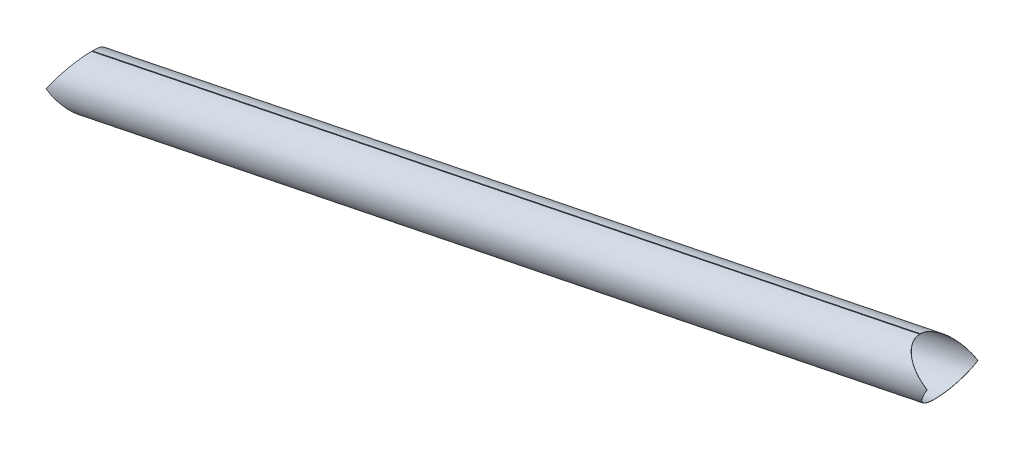
ISO-10303-21;
HEADER;
FILE_DESCRIPTION(('STEP AP214'),'2;1');
FILE_NAME('part.step','',(''),(''),'','','');
FILE_SCHEMA(('AUTOMOTIVE_DESIGN { 1 0 10303 214 1 1 1 1 }'));
ENDSEC;
DATA;
#1=APPLICATION_CONTEXT('core data for automotive mechanical design processes');
#2=APPLICATION_PROTOCOL_DEFINITION('international standard','automotive_design',2000,#1);
#3=PRODUCT_CONTEXT('',#1,'mechanical');
#4=PRODUCT('Part','Part','',(#3));
#5=PRODUCT_RELATED_PRODUCT_CATEGORY('part','',(#4));
#6=PRODUCT_DEFINITION_FORMATION('','',#4);
#7=PRODUCT_DEFINITION_CONTEXT('part definition',#1,'design');
#8=PRODUCT_DEFINITION('design','',#6,#7);
#9=PRODUCT_DEFINITION_SHAPE('','',#8);
#10=(LENGTH_UNIT() NAMED_UNIT(*) SI_UNIT(.MILLI.,.METRE.));
#11=(NAMED_UNIT(*) PLANE_ANGLE_UNIT() SI_UNIT($,.RADIAN.));
#12=(NAMED_UNIT(*) SI_UNIT($,.STERADIAN.) SOLID_ANGLE_UNIT());
#13=UNCERTAINTY_MEASURE_WITH_UNIT(LENGTH_MEASURE(1.E-05),#10,'distance_accuracy_value','');
#14=(GEOMETRIC_REPRESENTATION_CONTEXT(3) GLOBAL_UNCERTAINTY_ASSIGNED_CONTEXT((#13)) GLOBAL_UNIT_ASSIGNED_CONTEXT((#10,
#11,#12)) REPRESENTATION_CONTEXT('',''));
#15=CARTESIAN_POINT('',(0.,0.,0.));
#16=DIRECTION('',(0.,0.,1.));
#17=DIRECTION('',(1.,0.,0.));
#18=AXIS2_PLACEMENT_3D('',#15,#16,#17);
#19=CARTESIAN_POINT('',(495.062825272068,513.488846266379,-1.12852863294449E-10));
#20=CARTESIAN_POINT('',(495.069492097507,513.456186435551,-1.1284501447802E-10));
#21=CARTESIAN_POINT('',(495.076158922945,513.423526604724,-1.12837165661591E-10));
#22=CARTESIAN_POINT('',(495.082825748384,513.390866773896,-1.12829316845163E-10));
#23=CARTESIAN_POINT('',(495.062825272068,513.488846266371,-31.5000000001128));
#24=CARTESIAN_POINT('',(495.069492097507,513.456186435544,-31.5666666667795));
#25=CARTESIAN_POINT('',(495.076158922946,513.423526604716,-31.6333333334462));
#26=CARTESIAN_POINT('',(495.082825748384,513.390866773889,-31.7000000001128));
#27=CARTESIAN_POINT('',(454.591151385622,537.376980259267,-31.5000000001187));
#28=CARTESIAN_POINT('',(454.584484560184,537.409640090095,-31.5666666667854));
#29=CARTESIAN_POINT('',(454.577817734745,537.442299920922,-31.6333333334521));
#30=CARTESIAN_POINT('',(454.571150909306,537.474959751749,-31.7000000001188));
#31=CARTESIAN_POINT('',(454.591151385622,537.376980259274,-1.18753017777534E-10));
#32=CARTESIAN_POINT('',(454.584484560183,537.409640090102,-1.18760870676119E-10));
#33=CARTESIAN_POINT('',(454.577817734745,537.442299920929,-1.18768723574703E-10));
#34=CARTESIAN_POINT('',(454.571150909306,537.474959751757,-1.18776576473288E-10));
#35=CARTESIAN_POINT('',(454.591151385622,537.376980259282,31.4999999998812));
#36=CARTESIAN_POINT('',(454.584484560183,537.40964009011,31.5666666665479));
#37=CARTESIAN_POINT('',(454.577817734745,537.442299920937,31.6333333332145));
#38=CARTESIAN_POINT('',(454.571150909306,537.474959751764,31.6999999998812));
#39=CARTESIAN_POINT('',(495.062825272068,513.488846266386,31.4999999998871));
#40=CARTESIAN_POINT('',(495.069492097507,513.456186435559,31.5666666665538));
#41=CARTESIAN_POINT('',(495.076158922945,513.423526604731,31.6333333332205));
#42=CARTESIAN_POINT('',(495.082825748384,513.390866773904,31.6999999998871));
#43=CARTESIAN_POINT('',(495.062825272068,513.488846266379,-1.12852863294449E-10));
#44=CARTESIAN_POINT('',(495.069492097507,513.456186435551,-1.1284501447802E-10));
#45=CARTESIAN_POINT('',(495.076158922945,513.423526604724,-1.12837165661591E-10));
#46=CARTESIAN_POINT('',(495.082825748384,513.390866773896,-1.12829316845163E-10));
#47=(BOUNDED_SURFACE() B_SPLINE_SURFACE(3,3,((#19,#20,#21,#22),(#23,#24,#25,#26),(#27,#28,#29,
#30),(#31,#32,#33,#34),(#35,#36,#37,#38),(#39,#40,#41,#42),(#43,#44,#45,#46)),.UNSPECIFIED.,.T.,
.F.,.F.) B_SPLINE_SURFACE_WITH_KNOTS((4,3,4),(4,4),(0.,0.5,1.),(0.,1.),
.UNSPECIFIED.) GEOMETRIC_REPRESENTATION_ITEM() RATIONAL_B_SPLINE_SURFACE(((1.,1.,1.,1.),
(0.333333333333333,0.333333333333333,0.333333333333333,0.333333333333333),(0.333333333333333,
0.333333333333333,0.333333333333333,0.333333333333333),(1.,1.,1.,1.),(0.333333333333333,
0.333333333333333,0.333333333333333,0.333333333333333),(0.333333333333333,0.333333333333333,
0.333333333333333,0.333333333333333),(1.,1.,1.,1.))) REPRESENTATION_ITEM('') SURFACE());
#48=DIRECTION('',(0.,2.38155096765019E-13,1.));
#49=VECTOR('',#48,1.);
#50=CARTESIAN_POINT('',(474.826988328845,525.43291326283,15.8499999998842));
#51=LINE('',#50,#49);
#52=CARTESIAN_POINT('',(474.826988328845,525.43291326283,15.7499999998842));
#53=VERTEX_POINT('',#52);
#54=CARTESIAN_POINT('',(474.826988328845,525.43291326283,15.8499999998842));
#55=VERTEX_POINT('',#54);
#56=EDGE_CURVE('E11',#53,#55,#51,.T.);
#57=CARTESIAN_POINT('',(474.826988328845,525.432913262827,-1.15801976126637E-10));
#58=DIRECTION('',(0.508304270122154,0.861177547881727,-2.03932847172194E-13));
#59=DIRECTION('',(0.861177547881727,-0.508304270122154,1.25505545650333E-13));
#60=AXIS2_PLACEMENT_3D('',#57,#58,#59);
#61=ELLIPSE('',#60,23.4978686950189,15.75);
#62=CARTESIAN_POINT('',(454.59403916192,537.375275768688,0.266073271324946));
#63=VERTEX_POINT('',#62);
#64=EDGE_CURVE('E128',#63,#53,#61,.T.);
#65=DIRECTION('',(-0.199976221267158,0.979655102165405,0.016893541043806));
#66=VECTOR('',#65,1.);
#67=CARTESIAN_POINT('',(454.574041539793,537.473241278905,0.267762625429327));
#68=LINE('',#67,#66);
#69=CARTESIAN_POINT('',(454.574041539793,537.473241278905,0.267762625429327));
#70=VERTEX_POINT('',#69);
#71=EDGE_CURVE('E60',#63,#70,#68,.T.);
#72=CARTESIAN_POINT('',(474.826988328845,525.432913262827,-1.15801976126637E-10));
#73=DIRECTION('',(0.511013787156626,0.859572515460937,-2.0353659132569E-13));
#74=DIRECTION('',(0.859572515460937,-0.511013787156626,1.26147152707719E-13));
#75=AXIS2_PLACEMENT_3D('',#72,#73,#74);
#76=ELLIPSE('',#75,23.5650129049052,15.85);
#77=EDGE_CURVE('E197',#70,#55,#76,.T.);
#78=ORIENTED_EDGE('',*,*,#56,.F.);
#79=ORIENTED_EDGE('',*,*,#64,.F.);
#80=ORIENTED_EDGE('',*,*,#71,.T.);
#81=ORIENTED_EDGE('',*,*,#77,.T.);
#82=EDGE_LOOP('',(#78,#79,#80,#81));
#83=FACE_BOUND('',#82,.T.);
#84=ADVANCED_FACE('F47',(#83),#47,.F.);
#85=CARTESIAN_POINT('',(197.211004514227,484.937928060556,0.267762625440766));
#86=DIRECTION('',(0.00337878867538019,-0.0165522057770522,0.999857293952993));
#87=DIRECTION('',(0.979794924826004,0.200004763156293,0.));
#88=AXIS2_PLACEMENT_3D('',#85,#86,#87);
#89=PLANE('',#88);
#90=ORIENTED_EDGE('',*,*,#71,.F.);
#91=DIRECTION('',(0.979794924826004,0.200004763156293,0.));
#92=VECTOR('',#91,1.);
#93=CARTESIAN_POINT('',(-76.0818601050684,429.048824124233,0.266073271348534));
#94=LINE('',#93,#92);
#95=CARTESIAN_POINT('',(-60.1320348892134,432.30464933199,0.266073271347825));
#96=VERTEX_POINT('',#95);
#97=EDGE_CURVE('E164',#96,#63,#94,.T.);
#98=ORIENTED_EDGE('',*,*,#97,.F.);
#99=DIRECTION('',(-0.19997622126716,0.979655102165405,0.016893541043806));
#100=VECTOR('',#99,1.);
#101=CARTESIAN_POINT('',(-60.1520325113401,432.402614842207,0.267762625452205));
#102=LINE('',#101,#100);
#103=CARTESIAN_POINT('',(-60.1520325113401,432.402614842207,0.267762625452205));
#104=VERTEX_POINT('',#103);
#105=EDGE_CURVE('E188',#96,#104,#102,.T.);
#106=ORIENTED_EDGE('',*,*,#105,.T.);
#107=DIRECTION('',(0.979794924826004,0.200004763156293,0.));
#108=VECTOR('',#107,1.);
#109=CARTESIAN_POINT('',(-76.1018577271951,429.146789634449,0.267762625452914));
#110=LINE('',#109,#108);
#111=EDGE_CURVE('E207',#104,#70,#110,.T.);
#112=ORIENTED_EDGE('',*,*,#111,.T.);
#113=EDGE_LOOP('',(#90,#98,#106,#112));
#114=FACE_BOUND('',#113,.T.);
#115=ADVANCED_FACE('F212',(#114),#89,.F.);
#116=CARTESIAN_POINT('',(-60.150208438911,432.405295723637,-9.55668955902229E-11));
#117=CARTESIAN_POINT('',(-60.1435416134725,432.37263589281,-9.55596749175297E-11));
#118=CARTESIAN_POINT('',(-60.1368747880339,432.339976061982,-9.55524542448365E-11));
#119=CARTESIAN_POINT('',(-60.1302079625954,432.307316231154,-9.55452335721434E-11));
#120=CARTESIAN_POINT('',(-60.150208438911,432.40529572363,-31.7000000000956));
#121=CARTESIAN_POINT('',(-60.1435416134725,432.372635892803,-31.6333333334289));
#122=CARTESIAN_POINT('',(-60.136874788034,432.339976061975,-31.5666666667622));
#123=CARTESIAN_POINT('',(-60.1302079625954,432.307316231147,-31.5000000000956));
#124=CARTESIAN_POINT('',(-85.7142608013111,394.833216806611,-31.7000000000873));
#125=CARTESIAN_POINT('',(-85.7209276267496,394.865876637439,-31.6333333334206));
#126=CARTESIAN_POINT('',(-85.7275944521882,394.898536468267,-31.566666666754));
#127=CARTESIAN_POINT('',(-85.7342612776267,394.931196299094,-31.5000000000873));
#128=CARTESIAN_POINT('',(-85.7142608013111,394.833216806618,-8.72799701098123E-11));
#129=CARTESIAN_POINT('',(-85.7209276267496,394.865876637446,-8.72871948646615E-11));
#130=CARTESIAN_POINT('',(-85.7275944521882,394.898536468274,-8.72944196195107E-11));
#131=CARTESIAN_POINT('',(-85.7342612776267,394.931196299101,-8.73016443743598E-11));
#132=CARTESIAN_POINT('',(-85.7142608013111,394.833216806626,31.6999999999127));
#133=CARTESIAN_POINT('',(-85.7209276267497,394.865876637453,31.6333333332461));
#134=CARTESIAN_POINT('',(-85.7275944521882,394.898536468281,31.5666666665794));
#135=CARTESIAN_POINT('',(-85.7342612776267,394.931196299108,31.4999999999127));
#136=CARTESIAN_POINT('',(-60.1502084389111,432.405295723644,31.6999999999044));
#137=CARTESIAN_POINT('',(-60.1435416134725,432.372635892817,31.6333333332378));
#138=CARTESIAN_POINT('',(-60.136874788034,432.339976061989,31.5666666665711));
#139=CARTESIAN_POINT('',(-60.1302079625954,432.307316231161,31.4999999999045));
#140=CARTESIAN_POINT('',(-60.150208438911,432.405295723637,-9.55668955902229E-11));
#141=CARTESIAN_POINT('',(-60.1435416134725,432.37263589281,-9.55596749175297E-11));
#142=CARTESIAN_POINT('',(-60.1368747880339,432.339976061982,-9.55524542448365E-11));
#143=CARTESIAN_POINT('',(-60.1302079625954,432.307316231154,-9.55452335721434E-11));
#144=(BOUNDED_SURFACE() B_SPLINE_SURFACE(3,3,((#116,#117,#118,#119),(#120,#121,#122,#123),(#124,
#125,#126,#127),(#128,#129,#130,#131),(#132,#133,#134,#135),(#136,#137,#138,#139),(#140,#141,
#142,#143)),.UNSPECIFIED.,.T.,.F.,.F.) B_SPLINE_SURFACE_WITH_KNOTS((4,3,4),(4,4),(0.,0.5,1.),
(0.,1.),.UNSPECIFIED.) GEOMETRIC_REPRESENTATION_ITEM() RATIONAL_B_SPLINE_SURFACE(((1.,1.,1.,1.),
(0.333333333333333,0.333333333333333,0.333333333333333,0.333333333333333),(0.333333333333333,
0.333333333333333,0.333333333333333,0.333333333333333),(1.,1.,1.,1.),(0.333333333333333,
0.333333333333333,0.333333333333333,0.333333333333333),(0.333333333333333,0.333333333333333,
0.333333333333333,0.333333333333333),(1.,1.,1.,1.))) REPRESENTATION_ITEM('') SURFACE());
#145=CARTESIAN_POINT('',(-72.9322346201111,413.619256265128,-9.14244033826059E-11));
#146=DIRECTION('',(0.824989080461625,-0.565148668156515,1.25411033938024E-13));
#147=DIRECTION('',(0.565148668156515,0.824989080461625,-1.81915079199514E-13));
#148=AXIS2_PLACEMENT_3D('',#145,#146,#147);
#149=ELLIPSE('',#148,22.6524937221832,15.75);
#150=CARTESIAN_POINT('',(-72.9322346201111,413.619256265131,15.7499999999086));
#151=VERTEX_POINT('',#150);
#152=EDGE_CURVE('E160',#151,#96,#149,.F.);
#153=DIRECTION('',(0.,2.19465775470557E-13,1.));
#154=VECTOR('',#153,1.);
#155=CARTESIAN_POINT('',(-72.9322346201111,413.619256265131,15.8499999999086));
#156=LINE('',#155,#154);
#157=CARTESIAN_POINT('',(-72.9322346201111,413.619256265131,15.8499999999086));
#158=VERTEX_POINT('',#157);
#159=EDGE_CURVE('E185',#151,#158,#156,.T.);
#160=CARTESIAN_POINT('',(-72.9322346201111,413.619256265128,-9.14244033826059E-11));
#161=DIRECTION('',(0.826772594060492,-0.562536290127565,1.24834984827299E-13));
#162=DIRECTION('',(0.562536290127566,0.826772594060492,-1.82310860994998E-13));
#163=AXIS2_PLACEMENT_3D('',#160,#161,#162);
#164=ELLIPSE('',#163,22.7221361635202,15.85);
#165=EDGE_CURVE('E214',#158,#104,#164,.F.);
#166=ORIENTED_EDGE('',*,*,#105,.F.);
#167=ORIENTED_EDGE('',*,*,#152,.F.);
#168=ORIENTED_EDGE('',*,*,#159,.T.);
#169=ORIENTED_EDGE('',*,*,#165,.T.);
#170=EDGE_LOOP('',(#166,#167,#168,#169));
#171=FACE_BOUND('',#170,.T.);
#172=ADVANCED_FACE('F281',(#171),#144,.T.);
#173=CARTESIAN_POINT('',(-54.6435793764522,401.175650434336,-8.86629862574432E-11));
#174=CARTESIAN_POINT('',(-54.6502462018908,401.208310265164,-8.86702069301363E-11));
#175=CARTESIAN_POINT('',(-54.6569130273293,401.240970095991,-8.86774276028295E-11));
#176=CARTESIAN_POINT('',(-54.6635798527679,401.273629926819,-8.86846482755227E-11));
#177=CARTESIAN_POINT('',(-54.6435793764523,401.175650434343,31.6999999999113));
#178=CARTESIAN_POINT('',(-54.6502462018908,401.208310265171,31.6333333332447));
#179=CARTESIAN_POINT('',(-54.6569130273293,401.240970095998,31.566666666578));
#180=CARTESIAN_POINT('',(-54.6635798527679,401.273629926826,31.4999999999113));
#181=CARTESIAN_POINT('',(-91.2208898637699,426.062862095926,31.6999999999058));
#182=CARTESIAN_POINT('',(-91.2142230383314,426.030202265099,31.6333333332392));
#183=CARTESIAN_POINT('',(-91.2075562128928,425.997542434271,31.5666666665725));
#184=CARTESIAN_POINT('',(-91.2008893874543,425.964882603444,31.4999999999058));
#185=CARTESIAN_POINT('',(-91.2208898637699,426.062862095919,-9.41877615729453E-11));
#186=CARTESIAN_POINT('',(-91.2142230383313,426.030202265092,-9.41805368180961E-11));
#187=CARTESIAN_POINT('',(-91.2075562128928,425.997542434264,-9.4173312063247E-11));
#188=CARTESIAN_POINT('',(-91.2008893874542,425.964882603437,-9.41660873083978E-11));
#189=CARTESIAN_POINT('',(-91.2208898637699,426.062862095912,-31.7000000000942));
#190=CARTESIAN_POINT('',(-91.2142230383313,426.030202265085,-31.6333333334275));
#191=CARTESIAN_POINT('',(-91.2075562128928,425.997542434257,-31.5666666667608));
#192=CARTESIAN_POINT('',(-91.2008893874542,425.96488260343,-31.5000000000942));
#193=CARTESIAN_POINT('',(-54.6435793764522,401.175650434329,-31.7000000000887));
#194=CARTESIAN_POINT('',(-54.6502462018908,401.208310265157,-31.633333333422));
#195=CARTESIAN_POINT('',(-54.6569130273293,401.240970095984,-31.5666666667553));
#196=CARTESIAN_POINT('',(-54.6635798527679,401.273629926812,-31.5000000000887));
#197=CARTESIAN_POINT('',(-54.6435793764522,401.175650434336,-8.86629862574432E-11));
#198=CARTESIAN_POINT('',(-54.6502462018908,401.208310265164,-8.86702069301363E-11));
#199=CARTESIAN_POINT('',(-54.6569130273293,401.240970095991,-8.86774276028295E-11));
#200=CARTESIAN_POINT('',(-54.6635798527679,401.273629926819,-8.86846482755227E-11));
#201=(BOUNDED_SURFACE() B_SPLINE_SURFACE(3,3,((#173,#174,#175,#176),(#177,#178,#179,#180),(#181,
#182,#183,#184),(#185,#186,#187,#188),(#189,#190,#191,#192),(#193,#194,#195,#196),(#197,#198,
#199,#200)),.UNSPECIFIED.,.T.,.F.,.F.) B_SPLINE_SURFACE_WITH_KNOTS((4,3,4),(4,4),(0.,0.5,1.),
(0.,1.),.UNSPECIFIED.) GEOMETRIC_REPRESENTATION_ITEM() RATIONAL_B_SPLINE_SURFACE(((1.,1.,1.,1.),
(0.333333333333333,0.333333333333333,0.333333333333333,0.333333333333333),(0.333333333333333,
0.333333333333333,0.333333333333333,0.333333333333333),(1.,1.,1.,1.),(0.333333333333333,
0.333333333333333,0.333333333333333,0.333333333333333),(0.333333333333333,0.333333333333333,
0.333333333333333,0.333333333333333),(1.,1.,1.,1.))) REPRESENTATION_ITEM('') SURFACE());
#202=CARTESIAN_POINT('',(-72.9322346201111,413.619256265128,-9.14244033826059E-11));
#203=DIRECTION('',(0.559917838656139,0.828548136172328,-1.8270488542989E-13));
#204=DIRECTION('',(0.828548136172328,-0.559917838656139,1.24257588555469E-13));
#205=AXIS2_PLACEMENT_3D('',#202,#203,#204);
#206=ELLIPSE('',#205,22.0489962740602,15.75);
#207=CARTESIAN_POINT('',(-72.932234620111,413.619256265124,-15.7500000000914));
#208=VERTEX_POINT('',#207);
#209=EDGE_CURVE('E156',#208,#151,#206,.F.);
#210=DIRECTION('',(0.,-2.21933391307963E-13,-1.));
#211=VECTOR('',#210,1.);
#212=CARTESIAN_POINT('',(-72.932234620111,413.619256265124,-15.8500000000914));
#213=LINE('',#212,#211);
#214=CARTESIAN_POINT('',(-72.932234620111,413.619256265124,-15.8500000000914));
#215=VERTEX_POINT('',#214);
#216=EDGE_CURVE('E68',#208,#215,#213,.T.);
#217=CARTESIAN_POINT('',(-72.9322346201111,413.619256265128,-9.14244033826059E-11));
#218=DIRECTION('',(0.562536290127566,0.826772594060492,-1.82310860994998E-13));
#219=DIRECTION('',(0.826772594060492,-0.562536290127565,1.24834984827299E-13));
#220=AXIS2_PLACEMENT_3D('',#217,#218,#219);
#221=ELLIPSE('',#220,22.1205387975411,15.85);
#222=EDGE_CURVE('E217',#215,#158,#221,.F.);
#223=ORIENTED_EDGE('',*,*,#159,.F.);
#224=ORIENTED_EDGE('',*,*,#209,.F.);
#225=ORIENTED_EDGE('',*,*,#216,.T.);
#226=ORIENTED_EDGE('',*,*,#222,.T.);
#227=EDGE_LOOP('',(#223,#224,#225,#226));
#228=FACE_BOUND('',#227,.T.);
#229=ADVANCED_FACE('F349',(#228),#201,.T.);
#230=CARTESIAN_POINT('',(-72.9322346201111,413.619256265128,-9.14244033826059E-11));
#231=DIRECTION('',(0.824989080461625,-0.565148668156515,1.25411033938024E-13));
#232=DIRECTION('',(0.565148668156515,0.824989080461625,-1.81915079199514E-13));
#233=AXIS2_PLACEMENT_3D('',#230,#231,#232);
#234=ELLIPSE('',#233,22.6524937221832,15.75);
#235=CARTESIAN_POINT('',(-60.1322846563474,432.304284728533,-0.283677445549191));
#236=VERTEX_POINT('',#235);
#237=EDGE_CURVE('E151',#236,#208,#234,.F.);
#238=DIRECTION('',(-0.199972319180575,0.979635986397496,-0.0180112663782273));
#239=VECTOR('',#238,1.);
#240=CARTESIAN_POINT('',(-60.1522818882655,432.402248327173,-0.285478572187014));
#241=LINE('',#240,#239);
#242=CARTESIAN_POINT('',(-60.1522818882655,432.402248327173,-0.285478572187014));
#243=VERTEX_POINT('',#242);
#244=EDGE_CURVE('E179',#236,#243,#241,.T.);
#245=EDGE_CURVE('E120',#243,#215,#164,.F.);
#246=ORIENTED_EDGE('',*,*,#216,.F.);
#247=ORIENTED_EDGE('',*,*,#237,.F.);
#248=ORIENTED_EDGE('',*,*,#244,.T.);
#249=ORIENTED_EDGE('',*,*,#245,.T.);
#250=EDGE_LOOP('',(#246,#247,#248,#249));
#251=FACE_BOUND('',#250,.T.);
#252=ADVANCED_FACE('F225',(#251),#144,.T.);
#253=CARTESIAN_POINT('',(-60.1526421221721,432.404013061912,-0.185494793788544));
#254=DIRECTION('',(-0.979794924826004,-0.200004763156293,0.));
#255=DIRECTION('',(0.00360233906607958,-0.017647347387085,-0.999837783984708));
#256=AXIS2_PLACEMENT_3D('',#253,#254,#255);
#257=PLANE('',#256);
#258=ORIENTED_EDGE('',*,*,#244,.F.);
#259=DIRECTION('',(-0.00360233906612226,0.0176473473870763,0.999837783984708));
#260=VECTOR('',#259,1.);
#261=CARTESIAN_POINT('',(-60.1326448902538,432.306049463271,-0.183693667173597));
#262=LINE('',#261,#260);
#263=CARTESIAN_POINT('',(-60.1326448902539,432.306049463272,-0.183693667150719));
#264=VERTEX_POINT('',#263);
#265=EDGE_CURVE('E147',#264,#236,#262,.F.);
#266=ORIENTED_EDGE('',*,*,#265,.F.);
#267=DIRECTION('',(-0.199972319180575,0.979635986397496,-0.0180112663782273));
#268=VECTOR('',#267,1.);
#269=CARTESIAN_POINT('',(-60.1526421221721,432.404013061912,-0.185494793788544));
#270=LINE('',#269,#268);
#271=CARTESIAN_POINT('',(-60.1526421221721,432.404013061912,-0.185494793788544));
#272=VERTEX_POINT('',#271);
#273=EDGE_CURVE('E175',#264,#272,#270,.T.);
#274=ORIENTED_EDGE('',*,*,#273,.T.);
#275=DIRECTION('',(0.00360233906607958,-0.017647347387085,-0.999837783984708));
#276=VECTOR('',#275,1.);
#277=CARTESIAN_POINT('',(-60.1526421221721,432.404013061912,-0.185494793788544));
#278=LINE('',#277,#276);
#279=EDGE_CURVE('E237',#272,#243,#278,.T.);
#280=ORIENTED_EDGE('',*,*,#279,.T.);
#281=EDGE_LOOP('',(#258,#266,#274,#280));
#282=FACE_BOUND('',#281,.T.);
#283=ADVANCED_FACE('F260',(#282),#257,.T.);
#284=CARTESIAN_POINT('',(454.574076496632,537.474771073698,-0.185494793811419));
#285=DIRECTION('',(-0.00360233906607958,0.017647347387085,0.999837783984708));
#286=DIRECTION('',(-0.979794924826004,-0.200004763156293,0.));
#287=AXIS2_PLACEMENT_3D('',#284,#285,#286);
#288=PLANE('',#287);
#289=ORIENTED_EDGE('',*,*,#273,.F.);
#290=DIRECTION('',(0.979794924826004,0.200004763156294,0.));
#291=VECTOR('',#290,1.);
#292=CARTESIAN_POINT('',(454.59407372855,537.376807475058,-0.183693667173597));
#293=LINE('',#292,#291);
#294=CARTESIAN_POINT('',(454.59407372855,537.376807475058,-0.183693667173597));
#295=VERTEX_POINT('',#294);
#296=EDGE_CURVE('E138',#295,#264,#293,.F.);
#297=ORIENTED_EDGE('',*,*,#296,.F.);
#298=DIRECTION('',(-0.199972319180575,0.979635986397496,-0.0180112663782273));
#299=VECTOR('',#298,1.);
#300=CARTESIAN_POINT('',(454.574076496632,537.474771073698,-0.185494793811419));
#301=LINE('',#300,#299);
#302=CARTESIAN_POINT('',(454.574076496632,537.474771073698,-0.185494793811419));
#303=VERTEX_POINT('',#302);
#304=EDGE_CURVE('E171',#295,#303,#301,.T.);
#305=ORIENTED_EDGE('',*,*,#304,.T.);
#306=DIRECTION('',(-0.979794924826004,-0.200004763156293,0.));
#307=VECTOR('',#306,1.);
#308=CARTESIAN_POINT('',(454.574076496632,537.474771073698,-0.185494793811419));
#309=LINE('',#308,#307);
#310=EDGE_CURVE('E244',#303,#272,#309,.T.);
#311=ORIENTED_EDGE('',*,*,#310,.T.);
#312=EDGE_LOOP('',(#289,#297,#305,#311));
#313=FACE_BOUND('',#312,.T.);
#314=ADVANCED_FACE('F263',(#313),#288,.T.);
#315=CARTESIAN_POINT('',(454.574076496632,537.474771073698,-0.185494793811419));
#316=DIRECTION('',(-0.979794924826004,-0.200004763156293,0.));
#317=DIRECTION('',(0.00360233906607958,-0.017647347387085,-0.999837783984708));
#318=AXIS2_PLACEMENT_3D('',#315,#316,#317);
#319=PLANE('',#318);
#320=ORIENTED_EDGE('',*,*,#304,.F.);
#321=DIRECTION('',(-0.00360233906612226,0.0176473473870763,0.999837783984708));
#322=VECTOR('',#321,1.);
#323=CARTESIAN_POINT('',(454.59407372855,537.376807475058,-0.183693667173597));
#324=LINE('',#323,#322);
#325=CARTESIAN_POINT('',(454.594433962457,537.37504274032,-0.283677445572078));
#326=VERTEX_POINT('',#325);
#327=EDGE_CURVE('E135',#295,#326,#324,.F.);
#328=ORIENTED_EDGE('',*,*,#327,.T.);
#329=DIRECTION('',(-0.199972319180578,0.979635986397495,-0.018011266378227));
#330=VECTOR('',#329,1.);
#331=CARTESIAN_POINT('',(454.574436730539,537.473006338959,-0.285478572209894));
#332=LINE('',#331,#330);
#333=CARTESIAN_POINT('',(454.574436730539,537.473006338959,-0.285478572209894));
#334=VERTEX_POINT('',#333);
#335=EDGE_CURVE('E119',#326,#334,#332,.T.);
#336=ORIENTED_EDGE('',*,*,#335,.T.);
#337=DIRECTION('',(0.00360233906607958,-0.017647347387085,-0.999837783984708));
#338=VECTOR('',#337,1.);
#339=CARTESIAN_POINT('',(454.574076496632,537.474771073698,-0.185494793811419));
#340=LINE('',#339,#338);
#341=EDGE_CURVE('E240',#303,#334,#340,.T.);
#342=ORIENTED_EDGE('',*,*,#341,.F.);
#343=EDGE_LOOP('',(#320,#328,#336,#342));
#344=FACE_BOUND('',#343,.T.);
#345=ADVANCED_FACE('F268',(#344),#319,.F.);
#346=CARTESIAN_POINT('',(474.826988328845,525.432913262827,-1.15801976126637E-10));
#347=DIRECTION('',(0.508304270122154,0.861177547881727,-2.03932847172194E-13));
#348=DIRECTION('',(0.861177547881727,-0.508304270122154,1.25505545650333E-13));
#349=AXIS2_PLACEMENT_3D('',#346,#347,#348);
#350=ELLIPSE('',#349,23.4978686950189,15.75);
#351=CARTESIAN_POINT('',(474.826988328845,525.432913262823,-15.7500000001158));
#352=VERTEX_POINT('',#351);
#353=EDGE_CURVE('E125',#352,#326,#350,.T.);
#354=DIRECTION('',(0.,-2.38155096765017E-13,-1.));
#355=VECTOR('',#354,1.);
#356=CARTESIAN_POINT('',(474.826988328845,525.432913262823,-15.8500000001158));
#357=LINE('',#356,#355);
#358=CARTESIAN_POINT('',(474.826988328845,525.432913262823,-15.8500000001158));
#359=VERTEX_POINT('',#358);
#360=EDGE_CURVE('E53',#352,#359,#357,.T.);
#361=EDGE_CURVE('E211',#359,#334,#76,.T.);
#362=ORIENTED_EDGE('',*,*,#335,.F.);
#363=ORIENTED_EDGE('',*,*,#353,.F.);
#364=ORIENTED_EDGE('',*,*,#360,.T.);
#365=ORIENTED_EDGE('',*,*,#361,.T.);
#366=EDGE_LOOP('',(#362,#363,#364,#365));
#367=FACE_BOUND('',#366,.T.);
#368=ADVANCED_FACE('F131',(#367),#47,.F.);
#369=CARTESIAN_POINT('',(485.792357643964,543.746057818028,-1.20137965799944E-10));
#370=CARTESIAN_POINT('',(485.785690818525,543.778717648856,-1.20145814616373E-10));
#371=CARTESIAN_POINT('',(485.779023993087,543.811377479683,-1.20153663432801E-10));
#372=CARTESIAN_POINT('',(485.772357167648,543.844037310511,-1.2016151224923E-10));
#373=CARTESIAN_POINT('',(485.792357643963,543.746057818036,31.4999999998798));
#374=CARTESIAN_POINT('',(485.785690818525,543.778717648863,31.5666666665465));
#375=CARTESIAN_POINT('',(485.779023993086,543.811377479691,31.6333333332132));
#376=CARTESIAN_POINT('',(485.772357167648,543.844037310519,31.6999999998798));
#377=CARTESIAN_POINT('',(463.861619013727,507.119768707633,31.4999999998885));
#378=CARTESIAN_POINT('',(463.868285839165,507.087108876805,31.5666666665552));
#379=CARTESIAN_POINT('',(463.874952664604,507.054449045977,31.6333333332219));
#380=CARTESIAN_POINT('',(463.881619490042,507.02178921515,31.6999999998885));
#381=CARTESIAN_POINT('',(463.861619013727,507.119768707625,-1.11464057634622E-10));
#382=CARTESIAN_POINT('',(463.868285839165,507.087108876797,-1.11456204736037E-10));
#383=CARTESIAN_POINT('',(463.874952664604,507.05444904597,-1.11448351837452E-10));
#384=CARTESIAN_POINT('',(463.881619490042,507.021789215142,-1.11440498938867E-10));
#385=CARTESIAN_POINT('',(463.861619013727,507.119768707617,-31.5000000001114));
#386=CARTESIAN_POINT('',(463.868285839165,507.08710887679,-31.5666666667781));
#387=CARTESIAN_POINT('',(463.874952664604,507.054449045962,-31.6333333334447));
#388=CARTESIAN_POINT('',(463.881619490042,507.021789215135,-31.7000000001114));
#389=CARTESIAN_POINT('',(485.792357643964,543.746057818021,-31.5000000001201));
#390=CARTESIAN_POINT('',(485.785690818525,543.778717648848,-31.5666666667868));
#391=CARTESIAN_POINT('',(485.779023993087,543.811377479676,-31.6333333334535));
#392=CARTESIAN_POINT('',(485.772357167648,543.844037310503,-31.7000000001201));
#393=CARTESIAN_POINT('',(485.792357643964,543.746057818028,-1.20137965799944E-10));
#394=CARTESIAN_POINT('',(485.785690818525,543.778717648856,-1.20145814616373E-10));
#395=CARTESIAN_POINT('',(485.779023993087,543.811377479683,-1.20153663432801E-10));
#396=CARTESIAN_POINT('',(485.772357167648,543.844037310511,-1.2016151224923E-10));
#397=(BOUNDED_SURFACE() B_SPLINE_SURFACE(3,3,((#369,#370,#371,#372),(#373,#374,#375,#376),(#377,
#378,#379,#380),(#381,#382,#383,#384),(#385,#386,#387,#388),(#389,#390,#391,#392),(#393,#394,
#395,#396)),.UNSPECIFIED.,.T.,.F.,.F.) B_SPLINE_SURFACE_WITH_KNOTS((4,3,4),(4,4),(0.,0.5,1.),
(0.,1.),.UNSPECIFIED.) GEOMETRIC_REPRESENTATION_ITEM() RATIONAL_B_SPLINE_SURFACE(((1.,1.,1.,1.),
(0.333333333333333,0.333333333333333,0.333333333333333,0.333333333333333),(0.333333333333333,
0.333333333333333,0.333333333333333,0.333333333333333),(1.,1.,1.,1.),(0.333333333333333,
0.333333333333333,0.333333333333333,0.333333333333333),(0.333333333333333,0.333333333333333,
0.333333333333333,0.333333333333333),(1.,1.,1.,1.))) REPRESENTATION_ITEM('') SURFACE());
#398=CARTESIAN_POINT('',(474.826988328845,525.432913262827,-1.15801976126637E-10));
#399=DIRECTION('',(0.857957983072745,-0.513719864597182,1.26787894251737E-13));
#400=DIRECTION('',(0.513719864597182,0.857957983072745,-2.03138076233767E-13));
#401=AXIS2_PLACEMENT_3D('',#398,#399,#400);
#402=ELLIPSE('',#401,21.3450366061212,15.75);
#403=EDGE_CURVE('E110',#53,#352,#402,.T.);
#404=CARTESIAN_POINT('',(474.826988328845,525.432913262827,-1.15801976126637E-10));
#405=DIRECTION('',(0.859572515460937,-0.511013787156626,1.26147152707719E-13));
#406=DIRECTION('',(0.511013787156626,0.859572515460937,-2.0353659132569E-13));
#407=AXIS2_PLACEMENT_3D('',#404,#405,#406);
#408=ELLIPSE('',#407,21.4189305922741,15.85);
#409=EDGE_CURVE('E113',#55,#359,#408,.T.);
#410=ORIENTED_EDGE('',*,*,#403,.F.);
#411=ORIENTED_EDGE('',*,*,#56,.T.);
#412=ORIENTED_EDGE('',*,*,#409,.T.);
#413=ORIENTED_EDGE('',*,*,#360,.F.);
#414=EDGE_LOOP('',(#410,#411,#412,#413));
#415=FACE_BOUND('',#414,.T.);
#416=ADVANCED_FACE('F49',(#415),#397,.F.);
#417=CARTESIAN_POINT('',(-72.9322346201106,413.619256265128,-9.14103732802019E-11));
#418=DIRECTION('',(0.979794924826004,0.200004763156293,0.));
#419=DIRECTION('',(-0.200004763156293,0.979794924826004,0.));
#420=AXIS2_PLACEMENT_3D('',#417,#418,#419);
#421=CYLINDRICAL_SURFACE('',#420,15.85);
#422=DIRECTION('',(0.979794924826004,0.200004763156293,0.));
#423=VECTOR('',#422,1.);
#424=CARTESIAN_POINT('',(-76.1017958791227,429.146486649528,-0.285478572186307));
#425=LINE('',#424,#423);
#426=EDGE_CURVE('E155',#334,#243,#425,.F.);
#427=ORIENTED_EDGE('',*,*,#426,.F.);
#428=ORIENTED_EDGE('',*,*,#361,.F.);
#429=ORIENTED_EDGE('',*,*,#409,.F.);
#430=ORIENTED_EDGE('',*,*,#77,.F.);
#431=ORIENTED_EDGE('',*,*,#111,.F.);
#432=ORIENTED_EDGE('',*,*,#165,.F.);
#433=ORIENTED_EDGE('',*,*,#222,.F.);
#434=ORIENTED_EDGE('',*,*,#245,.F.);
#435=EDGE_LOOP('',(#427,#428,#429,#430,#431,#432,#433,#434));
#436=FACE_BOUND('',#435,.T.);
#437=ADVANCED_FACE('F205',(#436),#421,.T.);
#438=CARTESIAN_POINT('',(454.574076496632,537.474771073698,-0.185494793811419));
#439=DIRECTION('',(0.199972319180575,-0.979635986397496,0.0180112663782273));
#440=DIRECTION('',(0.979794924826004,0.200004763156294,0.));
#441=AXIS2_PLACEMENT_3D('',#438,#439,#440);
#442=PLANE('',#441);
#443=ORIENTED_EDGE('',*,*,#426,.T.);
#444=ORIENTED_EDGE('',*,*,#279,.F.);
#445=ORIENTED_EDGE('',*,*,#310,.F.);
#446=ORIENTED_EDGE('',*,*,#341,.T.);
#447=EDGE_LOOP('',(#443,#444,#445,#446));
#448=FACE_BOUND('',#447,.T.);
#449=ADVANCED_FACE('F235',(#448),#442,.F.);
#450=CARTESIAN_POINT('',(-72.9322346201106,413.619256265128,-9.14103732802019E-11));
#451=DIRECTION('',(0.979794924826004,0.200004763156293,0.));
#452=DIRECTION('',(-0.200004763156293,0.979794924826004,0.));
#453=AXIS2_PLACEMENT_3D('',#450,#451,#452);
#454=CYLINDRICAL_SURFACE('',#453,15.75);
#455=DIRECTION('',(0.979794924826004,0.200004763156294,0.));
#456=VECTOR('',#455,1.);
#457=CARTESIAN_POINT('',(454.594433962457,537.37504274032,-0.283677445572073));
#458=LINE('',#457,#456);
#459=EDGE_CURVE('E141',#326,#236,#458,.F.);
#460=ORIENTED_EDGE('',*,*,#459,.T.);
#461=ORIENTED_EDGE('',*,*,#237,.T.);
#462=ORIENTED_EDGE('',*,*,#209,.T.);
#463=ORIENTED_EDGE('',*,*,#152,.T.);
#464=ORIENTED_EDGE('',*,*,#97,.T.);
#465=ORIENTED_EDGE('',*,*,#64,.T.);
#466=ORIENTED_EDGE('',*,*,#403,.T.);
#467=ORIENTED_EDGE('',*,*,#353,.T.);
#468=EDGE_LOOP('',(#460,#461,#462,#463,#464,#465,#466,#467));
#469=FACE_BOUND('',#468,.T.);
#470=ADVANCED_FACE('F124',(#469),#454,.F.);
#471=CARTESIAN_POINT('',(454.59407372855,537.376807475058,-0.183693667173597));
#472=DIRECTION('',(0.199972319180575,-0.979635986397496,0.0180112663782273));
#473=DIRECTION('',(0.979794924826004,0.200004763156294,0.));
#474=AXIS2_PLACEMENT_3D('',#471,#472,#473);
#475=PLANE('',#474);
#476=ORIENTED_EDGE('',*,*,#459,.F.);
#477=ORIENTED_EDGE('',*,*,#327,.F.);
#478=ORIENTED_EDGE('',*,*,#296,.T.);
#479=ORIENTED_EDGE('',*,*,#265,.T.);
#480=EDGE_LOOP('',(#476,#477,#478,#479));
#481=FACE_BOUND('',#480,.T.);
#482=ADVANCED_FACE('F266',(#481),#475,.T.);
#483=CLOSED_SHELL('',(#84,#115,#172,#229,#252,#283,#314,#345,#368,#416,#437,#449,#470,#482));
#484=MANIFOLD_SOLID_BREP('B2',#483);
#485=ADVANCED_BREP_SHAPE_REPRESENTATION('',(#18,#484),#14);
#486=SHAPE_DEFINITION_REPRESENTATION(#9,#485);
ENDSEC;
END-ISO-10303-21;
